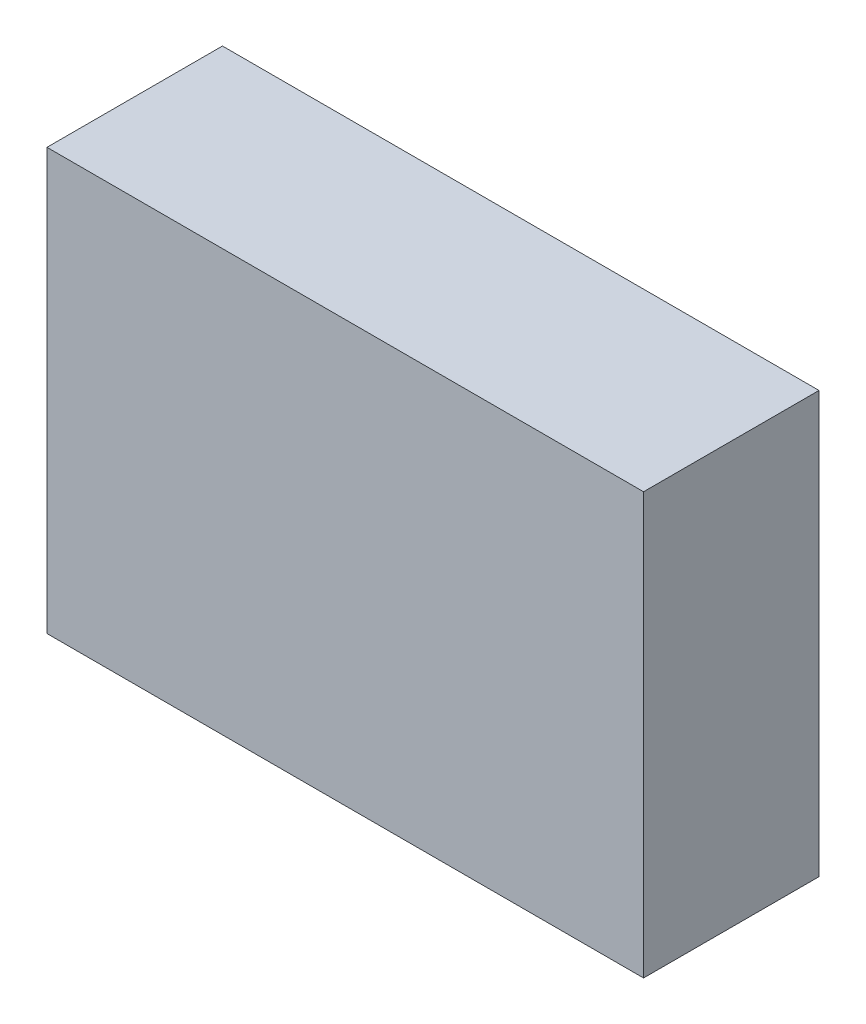
ISO-10303-21;
HEADER;
FILE_DESCRIPTION(('STEP AP214'),'2;1');
FILE_NAME('part.step','',(''),(''),'','','');
FILE_SCHEMA(('AUTOMOTIVE_DESIGN { 1 0 10303 214 1 1 1 1 }'));
ENDSEC;
DATA;
#1=APPLICATION_CONTEXT('core data for automotive mechanical design processes');
#2=APPLICATION_PROTOCOL_DEFINITION('international standard','automotive_design',2000,#1);
#3=PRODUCT_CONTEXT('',#1,'mechanical');
#4=PRODUCT('Part','Part','',(#3));
#5=PRODUCT_RELATED_PRODUCT_CATEGORY('part','',(#4));
#6=PRODUCT_DEFINITION_FORMATION('','',#4);
#7=PRODUCT_DEFINITION_CONTEXT('part definition',#1,'design');
#8=PRODUCT_DEFINITION('design','',#6,#7);
#9=PRODUCT_DEFINITION_SHAPE('','',#8);
#10=(LENGTH_UNIT() NAMED_UNIT(*) SI_UNIT(.MILLI.,.METRE.));
#11=(NAMED_UNIT(*) PLANE_ANGLE_UNIT() SI_UNIT($,.RADIAN.));
#12=(NAMED_UNIT(*) SI_UNIT($,.STERADIAN.) SOLID_ANGLE_UNIT());
#13=UNCERTAINTY_MEASURE_WITH_UNIT(LENGTH_MEASURE(1.E-05),#10,'distance_accuracy_value','');
#14=(GEOMETRIC_REPRESENTATION_CONTEXT(3) GLOBAL_UNCERTAINTY_ASSIGNED_CONTEXT((#13)) GLOBAL_UNIT_ASSIGNED_CONTEXT((#10,
#11,#12)) REPRESENTATION_CONTEXT('',''));
#15=CARTESIAN_POINT('',(0.,0.,0.));
#16=DIRECTION('',(0.,0.,1.));
#17=DIRECTION('',(1.,0.,0.));
#18=AXIS2_PLACEMENT_3D('',#15,#16,#17);
#19=CARTESIAN_POINT('',(-2.92,1.13,0.));
#20=DIRECTION('',(1.,0.,0.));
#21=DIRECTION('',(0.,0.,1.));
#22=AXIS2_PLACEMENT_3D('',#19,#20,#21);
#23=PLANE('',#22);
#24=DIRECTION('',(0.,1.,0.));
#25=VECTOR('',#24,1.);
#26=CARTESIAN_POINT('',(-2.92,1.13,0.1));
#27=LINE('',#26,#25);
#28=CARTESIAN_POINT('',(-2.92,1.13,0.1));
#29=VERTEX_POINT('',#28);
#30=CARTESIAN_POINT('',(-2.92,1.37,0.1));
#31=VERTEX_POINT('',#30);
#32=EDGE_CURVE('E11',#29,#31,#27,.T.);
#33=ORIENTED_EDGE('',*,*,#32,.T.);
#34=DIRECTION('',(0.,0.,1.));
#35=VECTOR('',#34,1.);
#36=CARTESIAN_POINT('',(-2.92,1.37,0.));
#37=LINE('',#36,#35);
#38=CARTESIAN_POINT('',(-2.92,1.37,0.));
#39=VERTEX_POINT('',#38);
#40=EDGE_CURVE('E24',#39,#31,#37,.T.);
#41=ORIENTED_EDGE('',*,*,#40,.F.);
#42=DIRECTION('',(0.,1.,0.));
#43=VECTOR('',#42,1.);
#44=CARTESIAN_POINT('',(-2.92,1.13,0.));
#45=LINE('',#44,#43);
#46=CARTESIAN_POINT('',(-2.92,1.13,0.));
#47=VERTEX_POINT('',#46);
#48=EDGE_CURVE('E86',#47,#39,#45,.T.);
#49=ORIENTED_EDGE('',*,*,#48,.F.);
#50=DIRECTION('',(0.,0.,1.));
#51=VECTOR('',#50,1.);
#52=CARTESIAN_POINT('',(-2.92,1.13,0.));
#53=LINE('',#52,#51);
#54=EDGE_CURVE('E36',#47,#29,#53,.T.);
#55=ORIENTED_EDGE('',*,*,#54,.T.);
#56=EDGE_LOOP('',(#33,#41,#49,#55));
#57=FACE_BOUND('',#56,.T.);
#58=ADVANCED_FACE('F17',(#57),#23,.F.);
#59=CARTESIAN_POINT('',(-2.58,1.13,0.));
#60=DIRECTION('',(1.,0.,0.));
#61=DIRECTION('',(0.,0.,1.));
#62=AXIS2_PLACEMENT_3D('',#59,#60,#61);
#63=PLANE('',#62);
#64=DIRECTION('',(0.,0.,1.));
#65=VECTOR('',#64,1.);
#66=CARTESIAN_POINT('',(-2.58,1.13,0.));
#67=LINE('',#66,#65);
#68=CARTESIAN_POINT('',(-2.58,1.13,0.));
#69=VERTEX_POINT('',#68);
#70=CARTESIAN_POINT('',(-2.58,1.13,0.1));
#71=VERTEX_POINT('',#70);
#72=EDGE_CURVE('E83',#69,#71,#67,.T.);
#73=ORIENTED_EDGE('',*,*,#72,.F.);
#74=DIRECTION('',(0.,1.,0.));
#75=VECTOR('',#74,1.);
#76=CARTESIAN_POINT('',(-2.58,1.13,0.));
#77=LINE('',#76,#75);
#78=CARTESIAN_POINT('',(-2.58,1.37,0.));
#79=VERTEX_POINT('',#78);
#80=EDGE_CURVE('E63',#69,#79,#77,.T.);
#81=ORIENTED_EDGE('',*,*,#80,.T.);
#82=DIRECTION('',(0.,0.,1.));
#83=VECTOR('',#82,1.);
#84=CARTESIAN_POINT('',(-2.58,1.37,0.));
#85=LINE('',#84,#83);
#86=CARTESIAN_POINT('',(-2.58,1.37,0.1));
#87=VERTEX_POINT('',#86);
#88=EDGE_CURVE('E57',#79,#87,#85,.T.);
#89=ORIENTED_EDGE('',*,*,#88,.T.);
#90=DIRECTION('',(0.,1.,0.));
#91=VECTOR('',#90,1.);
#92=CARTESIAN_POINT('',(-2.58,1.13,0.1));
#93=LINE('',#92,#91);
#94=EDGE_CURVE('E60',#71,#87,#93,.T.);
#95=ORIENTED_EDGE('',*,*,#94,.F.);
#96=EDGE_LOOP('',(#73,#81,#89,#95));
#97=FACE_BOUND('',#96,.T.);
#98=ADVANCED_FACE('F59',(#97),#63,.T.);
#99=CARTESIAN_POINT('',(-2.92,1.13,0.));
#100=DIRECTION('',(0.,1.,0.));
#101=DIRECTION('',(0.,0.,1.));
#102=AXIS2_PLACEMENT_3D('',#99,#100,#101);
#103=PLANE('',#102);
#104=ORIENTED_EDGE('',*,*,#72,.T.);
#105=DIRECTION('',(1.,0.,0.));
#106=VECTOR('',#105,1.);
#107=CARTESIAN_POINT('',(-2.92,1.13,0.1));
#108=LINE('',#107,#106);
#109=EDGE_CURVE('E71',#29,#71,#108,.T.);
#110=ORIENTED_EDGE('',*,*,#109,.F.);
#111=ORIENTED_EDGE('',*,*,#54,.F.);
#112=DIRECTION('',(1.,0.,0.));
#113=VECTOR('',#112,1.);
#114=CARTESIAN_POINT('',(-2.92,1.13,0.));
#115=LINE('',#114,#113);
#116=EDGE_CURVE('E76',#47,#69,#115,.T.);
#117=ORIENTED_EDGE('',*,*,#116,.T.);
#118=EDGE_LOOP('',(#104,#110,#111,#117));
#119=FACE_BOUND('',#118,.T.);
#120=ADVANCED_FACE('F91',(#119),#103,.F.);
#121=CARTESIAN_POINT('',(-2.92,1.37,0.));
#122=DIRECTION('',(0.,1.,0.));
#123=DIRECTION('',(0.,0.,1.));
#124=AXIS2_PLACEMENT_3D('',#121,#122,#123);
#125=PLANE('',#124);
#126=DIRECTION('',(1.,0.,0.));
#127=VECTOR('',#126,1.);
#128=CARTESIAN_POINT('',(-2.92,1.37,0.));
#129=LINE('',#128,#127);
#130=EDGE_CURVE('E74',#39,#79,#129,.T.);
#131=ORIENTED_EDGE('',*,*,#130,.F.);
#132=ORIENTED_EDGE('',*,*,#40,.T.);
#133=DIRECTION('',(1.,0.,0.));
#134=VECTOR('',#133,1.);
#135=CARTESIAN_POINT('',(-2.92,1.37,0.1));
#136=LINE('',#135,#134);
#137=EDGE_CURVE('E69',#31,#87,#136,.T.);
#138=ORIENTED_EDGE('',*,*,#137,.T.);
#139=ORIENTED_EDGE('',*,*,#88,.F.);
#140=EDGE_LOOP('',(#131,#132,#138,#139));
#141=FACE_BOUND('',#140,.T.);
#142=ADVANCED_FACE('F73',(#141),#125,.T.);
#143=CARTESIAN_POINT('',(-2.92,1.13,0.));
#144=DIRECTION('',(0.,0.,1.));
#145=DIRECTION('',(1.,0.,0.));
#146=AXIS2_PLACEMENT_3D('',#143,#144,#145);
#147=PLANE('',#146);
#148=ORIENTED_EDGE('',*,*,#130,.T.);
#149=ORIENTED_EDGE('',*,*,#80,.F.);
#150=ORIENTED_EDGE('',*,*,#116,.F.);
#151=ORIENTED_EDGE('',*,*,#48,.T.);
#152=EDGE_LOOP('',(#148,#149,#150,#151));
#153=FACE_BOUND('',#152,.T.);
#154=ADVANCED_FACE('F89',(#153),#147,.F.);
#155=CARTESIAN_POINT('',(-2.92,1.13,0.1));
#156=DIRECTION('',(0.,0.,1.));
#157=DIRECTION('',(1.,0.,0.));
#158=AXIS2_PLACEMENT_3D('',#155,#156,#157);
#159=PLANE('',#158);
#160=ORIENTED_EDGE('',*,*,#32,.F.);
#161=ORIENTED_EDGE('',*,*,#109,.T.);
#162=ORIENTED_EDGE('',*,*,#94,.T.);
#163=ORIENTED_EDGE('',*,*,#137,.F.);
#164=EDGE_LOOP('',(#160,#161,#162,#163));
#165=FACE_BOUND('',#164,.T.);
#166=ADVANCED_FACE('F68',(#165),#159,.T.);
#167=CLOSED_SHELL('',(#58,#98,#120,#142,#154,#166));
#168=MANIFOLD_SOLID_BREP('B1',#167);
#169=ADVANCED_BREP_SHAPE_REPRESENTATION('',(#18,#168),#14);
#170=SHAPE_DEFINITION_REPRESENTATION(#9,#169);
ENDSEC;
END-ISO-10303-21;
